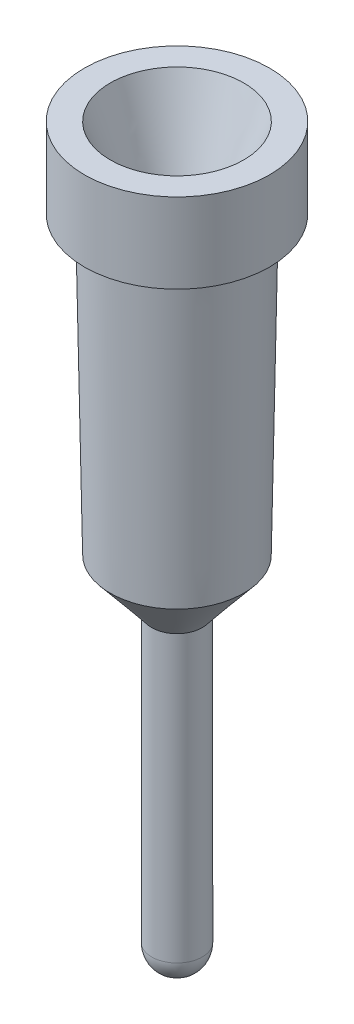
ISO-10303-21;
HEADER;
FILE_DESCRIPTION(('STEP AP214'),'2;1');
FILE_NAME('part.step','',(''),(''),'','','');
FILE_SCHEMA(('AUTOMOTIVE_DESIGN { 1 0 10303 214 1 1 1 1 }'));
ENDSEC;
DATA;
#1=APPLICATION_CONTEXT('core data for automotive mechanical design processes');
#2=APPLICATION_PROTOCOL_DEFINITION('international standard','automotive_design',2000,#1);
#3=PRODUCT_CONTEXT('',#1,'mechanical');
#4=PRODUCT('Part','Part','',(#3));
#5=PRODUCT_RELATED_PRODUCT_CATEGORY('part','',(#4));
#6=PRODUCT_DEFINITION_FORMATION('','',#4);
#7=PRODUCT_DEFINITION_CONTEXT('part definition',#1,'design');
#8=PRODUCT_DEFINITION('design','',#6,#7);
#9=PRODUCT_DEFINITION_SHAPE('','',#8);
#10=(LENGTH_UNIT() NAMED_UNIT(*) SI_UNIT(.MILLI.,.METRE.));
#11=(NAMED_UNIT(*) PLANE_ANGLE_UNIT() SI_UNIT($,.RADIAN.));
#12=(NAMED_UNIT(*) SI_UNIT($,.STERADIAN.) SOLID_ANGLE_UNIT());
#13=UNCERTAINTY_MEASURE_WITH_UNIT(LENGTH_MEASURE(1.E-05),#10,'distance_accuracy_value','');
#14=(GEOMETRIC_REPRESENTATION_CONTEXT(3) GLOBAL_UNCERTAINTY_ASSIGNED_CONTEXT((#13)) GLOBAL_UNIT_ASSIGNED_CONTEXT((#10,
#11,#12)) REPRESENTATION_CONTEXT('',''));
#15=CARTESIAN_POINT('',(0.,0.,0.));
#16=DIRECTION('',(0.,0.,1.));
#17=DIRECTION('',(1.,0.,0.));
#18=AXIS2_PLACEMENT_3D('',#15,#16,#17);
#19=CARTESIAN_POINT('',(0.,0.01,0.));
#20=DIRECTION('',(0.,-1.,0.));
#21=DIRECTION('',(0.,0.,-1.));
#22=AXIS2_PLACEMENT_3D('',#19,#20,#21);
#23=CYLINDRICAL_SURFACE('',#22,0.915);
#24=CARTESIAN_POINT('',(0.,0.01,0.));
#25=DIRECTION('',(0.,1.,0.));
#26=DIRECTION('',(0.,0.,1.));
#27=AXIS2_PLACEMENT_3D('',#24,#25,#26);
#28=CIRCLE('',#27,0.915);
#29=CARTESIAN_POINT('',(0.,0.01,-0.915));
#30=VERTEX_POINT('',#29);
#31=EDGE_CURVE('E48',#30,#30,#28,.T.);
#32=CARTESIAN_POINT('',(0.,-0.78,0.));
#33=DIRECTION('',(0.,1.,0.));
#34=DIRECTION('',(0.,0.,1.));
#35=AXIS2_PLACEMENT_3D('',#32,#33,#34);
#36=CIRCLE('',#35,0.915);
#37=CARTESIAN_POINT('',(0.,-0.78,-0.915));
#38=VERTEX_POINT('',#37);
#39=EDGE_CURVE('E52',#38,#38,#36,.T.);
#40=CARTESIAN_POINT('',(0.,0.01,-0.915));
#41=CARTESIAN_POINT('',(0.,0.00177083333333333,-0.915));
#42=CARTESIAN_POINT('',(0.,-0.00645833333333334,-0.915));
#43=CARTESIAN_POINT('',(0.,-0.0229166666666667,-0.915));
#44=CARTESIAN_POINT('',(0.,-0.0311458333333333,-0.915));
#45=CARTESIAN_POINT('',(0.,-0.0476041666666667,-0.915));
#46=CARTESIAN_POINT('',(0.,-0.0558333333333333,-0.915));
#47=CARTESIAN_POINT('',(0.,-0.0722916666666667,-0.915));
#48=CARTESIAN_POINT('',(0.,-0.0805208333333333,-0.915));
#49=CARTESIAN_POINT('',(0.,-0.0969791666666667,-0.915));
#50=CARTESIAN_POINT('',(0.,-0.105208333333333,-0.915));
#51=CARTESIAN_POINT('',(0.,-0.121666666666667,-0.915));
#52=CARTESIAN_POINT('',(0.,-0.129895833333333,-0.915));
#53=CARTESIAN_POINT('',(0.,-0.146354166666667,-0.915));
#54=CARTESIAN_POINT('',(0.,-0.154583333333333,-0.915));
#55=CARTESIAN_POINT('',(0.,-0.171041666666667,-0.915));
#56=CARTESIAN_POINT('',(0.,-0.179270833333333,-0.915));
#57=CARTESIAN_POINT('',(0.,-0.195729166666667,-0.915));
#58=CARTESIAN_POINT('',(0.,-0.203958333333333,-0.915));
#59=CARTESIAN_POINT('',(0.,-0.220416666666667,-0.915));
#60=CARTESIAN_POINT('',(0.,-0.228645833333333,-0.915));
#61=CARTESIAN_POINT('',(0.,-0.245104166666667,-0.915));
#62=CARTESIAN_POINT('',(0.,-0.253333333333333,-0.915));
#63=CARTESIAN_POINT('',(0.,-0.269791666666667,-0.915));
#64=CARTESIAN_POINT('',(0.,-0.278020833333333,-0.915));
#65=CARTESIAN_POINT('',(0.,-0.294479166666667,-0.915));
#66=CARTESIAN_POINT('',(0.,-0.302708333333333,-0.915));
#67=CARTESIAN_POINT('',(0.,-0.319166666666667,-0.915));
#68=CARTESIAN_POINT('',(0.,-0.327395833333333,-0.915));
#69=CARTESIAN_POINT('',(0.,-0.343854166666667,-0.915));
#70=CARTESIAN_POINT('',(0.,-0.352083333333333,-0.915));
#71=CARTESIAN_POINT('',(0.,-0.368541666666667,-0.915));
#72=CARTESIAN_POINT('',(0.,-0.376770833333333,-0.915));
#73=CARTESIAN_POINT('',(0.,-0.393229166666667,-0.915));
#74=CARTESIAN_POINT('',(0.,-0.401458333333333,-0.915));
#75=CARTESIAN_POINT('',(0.,-0.417916666666667,-0.915));
#76=CARTESIAN_POINT('',(0.,-0.426145833333333,-0.915));
#77=CARTESIAN_POINT('',(0.,-0.442604166666667,-0.915));
#78=CARTESIAN_POINT('',(0.,-0.450833333333333,-0.915));
#79=CARTESIAN_POINT('',(0.,-0.467291666666667,-0.915));
#80=CARTESIAN_POINT('',(0.,-0.475520833333333,-0.915));
#81=CARTESIAN_POINT('',(0.,-0.491979166666667,-0.915));
#82=CARTESIAN_POINT('',(0.,-0.500208333333333,-0.915));
#83=CARTESIAN_POINT('',(0.,-0.516666666666667,-0.915));
#84=CARTESIAN_POINT('',(0.,-0.524895833333333,-0.915));
#85=CARTESIAN_POINT('',(0.,-0.541354166666667,-0.915));
#86=CARTESIAN_POINT('',(0.,-0.549583333333333,-0.915));
#87=CARTESIAN_POINT('',(0.,-0.566041666666667,-0.915));
#88=CARTESIAN_POINT('',(0.,-0.574270833333333,-0.915));
#89=CARTESIAN_POINT('',(0.,-0.590729166666667,-0.915));
#90=CARTESIAN_POINT('',(0.,-0.598958333333333,-0.915));
#91=CARTESIAN_POINT('',(0.,-0.615416666666667,-0.915));
#92=CARTESIAN_POINT('',(0.,-0.623645833333333,-0.915));
#93=CARTESIAN_POINT('',(0.,-0.640104166666667,-0.915));
#94=CARTESIAN_POINT('',(0.,-0.648333333333333,-0.915));
#95=CARTESIAN_POINT('',(0.,-0.664791666666667,-0.915));
#96=CARTESIAN_POINT('',(0.,-0.673020833333333,-0.915));
#97=CARTESIAN_POINT('',(0.,-0.689479166666667,-0.915));
#98=CARTESIAN_POINT('',(0.,-0.697708333333333,-0.915));
#99=CARTESIAN_POINT('',(0.,-0.714166666666667,-0.915));
#100=CARTESIAN_POINT('',(0.,-0.722395833333333,-0.915));
#101=CARTESIAN_POINT('',(0.,-0.738854166666667,-0.915));
#102=CARTESIAN_POINT('',(0.,-0.747083333333333,-0.915));
#103=CARTESIAN_POINT('',(0.,-0.763541666666667,-0.915));
#104=CARTESIAN_POINT('',(0.,-0.771770833333333,-0.915));
#105=CARTESIAN_POINT('',(0.,-0.78,-0.915));
#106=B_SPLINE_CURVE_WITH_KNOTS('',3,(#40,#41,#42,#43,#44,#45,#46,#47,#48,#49,#50,#51,#52,#53,
#54,#55,#56,#57,#58,#59,#60,#61,#62,#63,#64,#65,#66,#67,#68,#69,#70,#71,#72,#73,#74,#75,#76,#77,
#78,#79,#80,#81,#82,#83,#84,#85,#86,#87,#88,#89,#90,#91,#92,#93,#94,#95,#96,#97,#98,#99,#100,
#101,#102,#103,#104,#105),.UNSPECIFIED.,.F.,.F.,(4,2,2,2,2,2,2,2,2,2,2,2,2,2,2,2,2,2,2,2,2,2,2,
2,2,2,2,2,2,2,2,2,4),(0.,0.0246875,0.049375,0.0740625,0.09875,0.1234375,0.148125,0.1728125,
0.1975,0.2221875,0.246875,0.2715625,0.29625,0.3209375,0.345625,0.3703125,0.395,0.4196875,
0.444375,0.4690625,0.49375,0.5184375,0.543125,0.5678125,0.5925,0.6171875,0.641875,0.6665625,
0.69125,0.7159375,0.740625,0.7653125,0.79),.UNSPECIFIED.);
#107=EDGE_CURVE('BSEAM41',#30,#38,#106,.T.);
#108=ORIENTED_EDGE('',*,*,#31,.F.);
#109=ORIENTED_EDGE('',*,*,#39,.T.);
#110=ORIENTED_EDGE('',*,*,#107,.T.);
#111=ORIENTED_EDGE('',*,*,#107,.F.);
#112=EDGE_LOOP('',(#108,#110,#109,#111));
#113=FACE_BOUND('',#112,.T.);
#114=ADVANCED_FACE('F41',(#113),#23,.T.);
#115=CARTESIAN_POINT('',(0.,0.01,0.));
#116=DIRECTION('',(0.,1.,0.));
#117=DIRECTION('',(0.,0.,1.));
#118=AXIS2_PLACEMENT_3D('',#115,#116,#117);
#119=PLANE('',#118);
#120=CARTESIAN_POINT('',(0.,0.01,0.));
#121=DIRECTION('',(0.,1.,0.));
#122=DIRECTION('',(0.,0.,1.));
#123=AXIS2_PLACEMENT_3D('',#120,#121,#122);
#124=CIRCLE('',#123,0.66);
#125=CARTESIAN_POINT('',(-0.190099229769747,0.01,-0.632030286332031));
#126=VERTEX_POINT('',#125);
#127=EDGE_CURVE('E116',#126,#126,#124,.T.);
#128=ORIENTED_EDGE('',*,*,#127,.F.);
#129=EDGE_LOOP('',(#128));
#130=FACE_BOUND('',#129,.T.);
#131=ORIENTED_EDGE('',*,*,#31,.T.);
#132=EDGE_LOOP('',(#131));
#133=FACE_BOUND('',#132,.T.);
#134=ADVANCED_FACE('F183',(#130,#133),#119,.T.);
#135=CARTESIAN_POINT('',(0.,-0.78,0.));
#136=DIRECTION('',(0.,1.,0.));
#137=DIRECTION('',(0.,0.,1.));
#138=AXIS2_PLACEMENT_3D('',#135,#136,#137);
#139=PLANE('',#138);
#140=CARTESIAN_POINT('',(0.,-0.78,0.));
#141=DIRECTION('',(0.,-1.,0.));
#142=DIRECTION('',(0.,0.,-1.));
#143=AXIS2_PLACEMENT_3D('',#140,#141,#142);
#144=CIRCLE('',#143,0.71);
#145=CARTESIAN_POINT('',(0.,-0.78,-0.71));
#146=VERTEX_POINT('',#145);
#147=EDGE_CURVE('E112',#146,#146,#144,.T.);
#148=ORIENTED_EDGE('',*,*,#147,.F.);
#149=EDGE_LOOP('',(#148));
#150=FACE_BOUND('',#149,.T.);
#151=ORIENTED_EDGE('',*,*,#39,.F.);
#152=EDGE_LOOP('',(#151));
#153=FACE_BOUND('',#152,.T.);
#154=ADVANCED_FACE('F188',(#150,#153),#139,.F.);
#155=CARTESIAN_POINT('',(0.,-3.7,0.));
#156=DIRECTION('',(0.,1.,0.));
#157=DIRECTION('',(0.,0.,1.));
#158=AXIS2_PLACEMENT_3D('',#155,#156,#157);
#159=CONICAL_SURFACE('',#158,0.66,0.0171216144097644);
#160=CARTESIAN_POINT('',(0.,-3.7,0.));
#161=DIRECTION('',(0.,-1.,0.));
#162=DIRECTION('',(0.,0.,-1.));
#163=AXIS2_PLACEMENT_3D('',#160,#161,#162);
#164=CIRCLE('',#163,0.66);
#165=CARTESIAN_POINT('',(0.622818826922703,-3.7,-0.21839576193376));
#166=VERTEX_POINT('',#165);
#167=EDGE_CURVE('E57',#166,#166,#164,.T.);
#168=ORIENTED_EDGE('',*,*,#167,.F.);
#169=EDGE_LOOP('',(#168));
#170=FACE_BOUND('',#169,.T.);
#171=ORIENTED_EDGE('',*,*,#147,.T.);
#172=EDGE_LOOP('',(#171));
#173=FACE_BOUND('',#172,.T.);
#174=ADVANCED_FACE('F91',(#170,#173),#159,.T.);
#175=CARTESIAN_POINT('',(0.209810113163095,-4.2,-0.135940120694698));
#176=CARTESIAN_POINT('',(0.622818826922703,-3.7,-0.21839576193376));
#177=CARTESIAN_POINT('',(-0.0620701282263007,-4.2,-0.555560347020889));
#178=CARTESIAN_POINT('',(0.186027303055183,-3.7,-1.46403341577917));
#179=CARTESIAN_POINT('',(-0.481690354552492,-4.2,-0.283680105631493));
#180=CARTESIAN_POINT('',(-1.05961035079022,-3.7,-1.02724189191165));
#181=CARTESIAN_POINT('',(-0.209810113163095,-4.2,0.135940120694698));
#182=CARTESIAN_POINT('',(-0.622818826922703,-3.7,0.21839576193376));
#183=CARTESIAN_POINT('',(0.0620701282263007,-4.2,0.555560347020889));
#184=CARTESIAN_POINT('',(-0.186027303055183,-3.7,1.46403341577917));
#185=CARTESIAN_POINT('',(0.481690354552492,-4.2,0.283680105631493));
#186=CARTESIAN_POINT('',(1.05961035079022,-3.7,1.02724189191165));
#187=CARTESIAN_POINT('',(0.209810113163095,-4.2,-0.135940120694698));
#188=CARTESIAN_POINT('',(0.622818826922703,-3.7,-0.21839576193376));
#189=(BOUNDED_SURFACE() B_SPLINE_SURFACE(3,1,((#175,#176),(#177,#178),(#179,#180),(#181,#182),
(#183,#184),(#185,#186),(#187,#188)),.UNSPECIFIED.,.T.,.F.,.F.) B_SPLINE_SURFACE_WITH_KNOTS((4,
3,4),(2,2),(0.,0.5,1.),(0.,1.),
.UNSPECIFIED.) GEOMETRIC_REPRESENTATION_ITEM() RATIONAL_B_SPLINE_SURFACE(((1.,1.),
(0.333333333333333,0.333333333333333),(0.333333333333333,0.333333333333333),(1.,1.),
(0.333333333333333,0.333333333333333),(0.333333333333333,0.333333333333333),(1.,1.))) REPRESENTATION_ITEM('') SURFACE());
#190=CARTESIAN_POINT('',(0.,-4.2,0.));
#191=DIRECTION('',(0.,-1.,0.));
#192=DIRECTION('',(0.,0.,-1.));
#193=AXIS2_PLACEMENT_3D('',#190,#191,#192);
#194=CIRCLE('',#193,0.25);
#195=CARTESIAN_POINT('',(0.209810113163095,-4.2,-0.135940120694698));
#196=VERTEX_POINT('',#195);
#197=EDGE_CURVE('E65',#196,#196,#194,.T.);
#198=CARTESIAN_POINT('',(0.209810113163095,-4.2,-0.135940120694698));
#199=CARTESIAN_POINT('',(0.214112287264758,-4.19479166666667,-0.136799033624272));
#200=CARTESIAN_POINT('',(0.218414461366421,-4.18958333333333,-0.137657946553845));
#201=CARTESIAN_POINT('',(0.227018809569746,-4.17916666666667,-0.139375772412992));
#202=CARTESIAN_POINT('',(0.231320983671408,-4.17395833333333,-0.140234685342566));
#203=CARTESIAN_POINT('',(0.239925331874734,-4.16354166666667,-0.141952511201713));
#204=CARTESIAN_POINT('',(0.244227505976396,-4.15833333333333,-0.142811424131287));
#205=CARTESIAN_POINT('',(0.252831854179721,-4.14791666666667,-0.144529249990434));
#206=CARTESIAN_POINT('',(0.257134028281384,-4.14270833333333,-0.145388162920007));
#207=CARTESIAN_POINT('',(0.265738376484709,-4.13229166666667,-0.147105988779154));
#208=CARTESIAN_POINT('',(0.270040550586372,-4.12708333333333,-0.147964901708728));
#209=CARTESIAN_POINT('',(0.278644898789697,-4.11666666666667,-0.149682727567875));
#210=CARTESIAN_POINT('',(0.282947072891359,-4.11145833333333,-0.150541640497449));
#211=CARTESIAN_POINT('',(0.291551421094685,-4.10104166666667,-0.152259466356596));
#212=CARTESIAN_POINT('',(0.295853595196347,-4.09583333333333,-0.153118379286169));
#213=CARTESIAN_POINT('',(0.304457943399672,-4.08541666666667,-0.154836205145316));
#214=CARTESIAN_POINT('',(0.308760117501335,-4.08020833333333,-0.15569511807489));
#215=CARTESIAN_POINT('',(0.31736446570466,-4.06979166666667,-0.157412943934037));
#216=CARTESIAN_POINT('',(0.321666639806323,-4.06458333333333,-0.158271856863611));
#217=CARTESIAN_POINT('',(0.330270988009648,-4.05416666666667,-0.159989682722758));
#218=CARTESIAN_POINT('',(0.33457316211131,-4.04895833333333,-0.160848595652331));
#219=CARTESIAN_POINT('',(0.343177510314636,-4.03854166666667,-0.162566421511478));
#220=CARTESIAN_POINT('',(0.347479684416298,-4.03333333333333,-0.163425334441052));
#221=CARTESIAN_POINT('',(0.356084032619623,-4.02291666666667,-0.165143160300199));
#222=CARTESIAN_POINT('',(0.360386206721286,-4.01770833333333,-0.166002073229773));
#223=CARTESIAN_POINT('',(0.368990554924611,-4.00729166666667,-0.16771989908892));
#224=CARTESIAN_POINT('',(0.373292729026273,-4.00208333333333,-0.168578812018493));
#225=CARTESIAN_POINT('',(0.381897077229599,-3.99166666666667,-0.170296637877641));
#226=CARTESIAN_POINT('',(0.386199251331262,-3.98645833333333,-0.171155550807214));
#227=CARTESIAN_POINT('',(0.394803599534587,-3.97604166666667,-0.172873376666361));
#228=CARTESIAN_POINT('',(0.399105773636249,-3.97083333333333,-0.173732289595935));
#229=CARTESIAN_POINT('',(0.407710121839574,-3.96041666666667,-0.175450115455082));
#230=CARTESIAN_POINT('',(0.412012295941237,-3.95520833333333,-0.176309028384655));
#231=CARTESIAN_POINT('',(0.420616644144562,-3.94479166666667,-0.178026854243803));
#232=CARTESIAN_POINT('',(0.424918818246225,-3.93958333333333,-0.178885767173376));
#233=CARTESIAN_POINT('',(0.43352316644955,-3.92916666666667,-0.180603593032523));
#234=CARTESIAN_POINT('',(0.437825340551212,-3.92395833333333,-0.181462505962097));
#235=CARTESIAN_POINT('',(0.446429688754537,-3.91354166666667,-0.183180331821244));
#236=CARTESIAN_POINT('',(0.4507318628562,-3.90833333333333,-0.184039244750818));
#237=CARTESIAN_POINT('',(0.459336211059525,-3.89791666666667,-0.185757070609965));
#238=CARTESIAN_POINT('',(0.463638385161188,-3.89270833333333,-0.186615983539538));
#239=CARTESIAN_POINT('',(0.472242733364513,-3.88229166666667,-0.188333809398685));
#240=CARTESIAN_POINT('',(0.476544907466176,-3.87708333333333,-0.189192722328259));
#241=CARTESIAN_POINT('',(0.485149255669501,-3.86666666666667,-0.190910548187406));
#242=CARTESIAN_POINT('',(0.489451429771163,-3.86145833333333,-0.19176946111698));
#243=CARTESIAN_POINT('',(0.498055777974489,-3.85104166666667,-0.193487286976127));
#244=CARTESIAN_POINT('',(0.502357952076151,-3.84583333333333,-0.1943461999057));
#245=CARTESIAN_POINT('',(0.510962300279476,-3.83541666666667,-0.196064025764847));
#246=CARTESIAN_POINT('',(0.515264474381139,-3.83020833333333,-0.196922938694421));
#247=CARTESIAN_POINT('',(0.523868822584464,-3.81979166666667,-0.198640764553568));
#248=CARTESIAN_POINT('',(0.528170996686127,-3.81458333333333,-0.199499677483142));
#249=CARTESIAN_POINT('',(0.536775344889452,-3.80416666666667,-0.201217503342289));
#250=CARTESIAN_POINT('',(0.541077518991114,-3.79895833333333,-0.202076416271862));
#251=CARTESIAN_POINT('',(0.54968186719444,-3.78854166666667,-0.203794242131009));
#252=CARTESIAN_POINT('',(0.553984041296102,-3.78333333333333,-0.204653155060583));
#253=CARTESIAN_POINT('',(0.562588389499427,-3.77291666666667,-0.20637098091973));
#254=CARTESIAN_POINT('',(0.56689056360109,-3.76770833333333,-0.207229893849304));
#255=CARTESIAN_POINT('',(0.575494911804415,-3.75729166666667,-0.208947719708451));
#256=CARTESIAN_POINT('',(0.579797085906078,-3.75208333333333,-0.209806632638024));
#257=CARTESIAN_POINT('',(0.588401434109403,-3.74166666666667,-0.211524458497171));
#258=CARTESIAN_POINT('',(0.592703608211065,-3.73645833333333,-0.212383371426745));
#259=CARTESIAN_POINT('',(0.60130795641439,-3.72604166666667,-0.214101197285892));
#260=CARTESIAN_POINT('',(0.605610130516053,-3.72083333333333,-0.214960110215466));
#261=CARTESIAN_POINT('',(0.614214478719378,-3.71041666666667,-0.216677936074613));
#262=CARTESIAN_POINT('',(0.618516652821041,-3.70520833333333,-0.217536849004186));
#263=CARTESIAN_POINT('',(0.622818826922703,-3.7,-0.21839576193376));
#264=B_SPLINE_CURVE_WITH_KNOTS('',3,(#198,#199,#200,#201,#202,#203,#204,#205,#206,#207,#208,
#209,#210,#211,#212,#213,#214,#215,#216,#217,#218,#219,#220,#221,#222,#223,#224,#225,#226,#227,
#228,#229,#230,#231,#232,#233,#234,#235,#236,#237,#238,#239,#240,#241,#242,#243,#244,#245,#246,
#247,#248,#249,#250,#251,#252,#253,#254,#255,#256,#257,#258,#259,#260,#261,#262,#263),
.UNSPECIFIED.,.F.,.F.,(4,2,2,2,2,2,2,2,2,2,2,2,2,2,2,2,2,2,2,2,2,2,2,2,2,2,2,2,2,2,2,2,4),(0.,
0.0204293545124276,0.0408587090248551,0.0612880635372827,0.0817174180497103,0.102146772562138,
0.122576127074565,0.143005481586993,0.16343483609942,0.183864190611848,0.204293545124276,
0.224722899636703,0.245152254149131,0.265581608661558,0.286010963173985,0.306440317686413,
0.326869672198841,0.347299026711268,0.367728381223696,0.388157735736123,0.408587090248551,
0.429016444760979,0.449445799273406,0.469875153785834,0.490304508298262,0.510733862810689,
0.531163217323116,0.551592571835544,0.572021926347972,0.592451280860399,0.612880635372827,
0.633309989885254,0.653739344397682),.UNSPECIFIED.);
#265=EDGE_CURVE('BSEAM80',#196,#166,#264,.T.);
#266=ORIENTED_EDGE('',*,*,#197,.F.);
#267=ORIENTED_EDGE('',*,*,#167,.T.);
#268=ORIENTED_EDGE('',*,*,#265,.T.);
#269=ORIENTED_EDGE('',*,*,#265,.F.);
#270=EDGE_LOOP('',(#266,#268,#267,#269));
#271=FACE_BOUND('',#270,.T.);
#272=ADVANCED_FACE('F80',(#271),#189,.T.);
#273=CARTESIAN_POINT('',(0.,-7.27,0.));
#274=DIRECTION('',(0.,1.,0.));
#275=DIRECTION('',(0.,0.,1.));
#276=AXIS2_PLACEMENT_3D('',#273,#274,#275);
#277=CYLINDRICAL_SURFACE('',#276,0.25);
#278=CARTESIAN_POINT('',(0.,-7.02,0.));
#279=DIRECTION('',(0.,1.,0.));
#280=DIRECTION('',(0.,0.,1.));
#281=AXIS2_PLACEMENT_3D('',#278,#279,#280);
#282=CIRCLE('',#281,0.25);
#283=CARTESIAN_POINT('',(0.,-7.02,0.25));
#284=VERTEX_POINT('',#283);
#285=EDGE_CURVE('E11',#284,#284,#282,.T.);
#286=ORIENTED_EDGE('',*,*,#285,.T.);
#287=EDGE_LOOP('',(#286));
#288=FACE_BOUND('',#287,.T.);
#289=ORIENTED_EDGE('',*,*,#197,.T.);
#290=EDGE_LOOP('',(#289));
#291=FACE_BOUND('',#290,.T.);
#292=ADVANCED_FACE('F70',(#288,#291),#277,.T.);
#293=CARTESIAN_POINT('',(0.,-7.02,0.));
#294=DIRECTION('',(0.,0.,1.));
#295=DIRECTION('',(1.,0.,0.));
#296=AXIS2_PLACEMENT_3D('',#293,#294,#295);
#297=SPHERICAL_SURFACE('',#296,0.25);
#298=CARTESIAN_POINT('',(0.,-7.02,0.));
#299=DIRECTION('',(0.,1.,0.));
#300=DIRECTION('',(0.,0.,1.));
#301=AXIS2_PLACEMENT_3D('',#298,#299,#300);
#302=SPHERICAL_SURFACE('',#301,0.25);
#303=ORIENTED_EDGE('',*,*,#285,.F.);
#304=EDGE_LOOP('',(#303));
#305=FACE_BOUND('',#304,.T.);
#306=ADVANCED_FACE('F43',(#305),#302,.T.);
#307=CARTESIAN_POINT('',(-0.190099229769747,0.01,-0.632030286332031));
#308=CARTESIAN_POINT('',(-0.0429027436629655,-0.78,-0.372537722366729));
#309=CARTESIAN_POINT('',(1.07396134289431,0.01,-1.01222874587153));
#310=CARTESIAN_POINT('',(0.702172701070493,-0.78,-0.45834320969266));
#311=CARTESIAN_POINT('',(1.45415980243381,0.01,0.251831826792536));
#312=CARTESIAN_POINT('',(0.787978188396423,-0.78,0.286732235040799));
#313=CARTESIAN_POINT('',(0.190099229769747,0.01,0.632030286332031));
#314=CARTESIAN_POINT('',(0.0429027436629651,-0.78,0.372537722366729));
#315=CARTESIAN_POINT('',(-1.07396134289431,0.01,1.01222874587153));
#316=CARTESIAN_POINT('',(-0.702172701070492,-0.78,0.458343209692659));
#317=CARTESIAN_POINT('',(-1.45415980243381,0.01,-0.251831826792537));
#318=CARTESIAN_POINT('',(-0.787978188396423,-0.78,-0.286732235040799));
#319=CARTESIAN_POINT('',(-0.190099229769747,0.01,-0.632030286332031));
#320=CARTESIAN_POINT('',(-0.0429027436629655,-0.78,-0.372537722366729));
#321=(BOUNDED_SURFACE() B_SPLINE_SURFACE(3,1,((#307,#308),(#309,#310),(#311,#312),(#313,#314),
(#315,#316),(#317,#318),(#319,#320)),.UNSPECIFIED.,.T.,.F.,.F.) B_SPLINE_SURFACE_WITH_KNOTS((4,
3,4),(2,2),(0.,0.5,1.),(0.,1.),
.UNSPECIFIED.) GEOMETRIC_REPRESENTATION_ITEM() RATIONAL_B_SPLINE_SURFACE(((1.,1.),
(0.333333333333333,0.333333333333333),(0.333333333333333,0.333333333333333),(1.,1.),
(0.333333333333333,0.333333333333333),(0.333333333333333,0.333333333333333),(1.,1.))) REPRESENTATION_ITEM('') SURFACE());
#322=CARTESIAN_POINT('',(0.,-0.78,0.));
#323=DIRECTION('',(0.,-1.,0.));
#324=DIRECTION('',(0.,0.,-1.));
#325=AXIS2_PLACEMENT_3D('',#322,#323,#324);
#326=CIRCLE('',#325,0.375);
#327=CARTESIAN_POINT('',(-0.0429027436629655,-0.78,-0.372537722366729));
#328=VERTEX_POINT('',#327);
#329=EDGE_CURVE('E118',#328,#328,#326,.T.);
#330=CARTESIAN_POINT('',(-0.190099229769747,0.01,-0.632030286332031));
#331=CARTESIAN_POINT('',(-0.188565933039468,0.00177083333333331,-0.629327238790726));
#332=CARTESIAN_POINT('',(-0.187032636309189,-0.00645833333333335,-0.62662419124942));
#333=CARTESIAN_POINT('',(-0.183966042848631,-0.0229166666666667,-0.62121809616681));
#334=CARTESIAN_POINT('',(-0.182432746118352,-0.0311458333333333,-0.618515048625505));
#335=CARTESIAN_POINT('',(-0.179366152657794,-0.0476041666666667,-0.613108953542894));
#336=CARTESIAN_POINT('',(-0.177832855927515,-0.0558333333333333,-0.610405906001589));
#337=CARTESIAN_POINT('',(-0.174766262466958,-0.0722916666666667,-0.604999810918979));
#338=CARTESIAN_POINT('',(-0.173232965736679,-0.0805208333333333,-0.602296763377673));
#339=CARTESIAN_POINT('',(-0.170166372276121,-0.0969791666666667,-0.596890668295063));
#340=CARTESIAN_POINT('',(-0.168633075545842,-0.105208333333333,-0.594187620753758));
#341=CARTESIAN_POINT('',(-0.165566482085284,-0.121666666666667,-0.588781525671147));
#342=CARTESIAN_POINT('',(-0.164033185355005,-0.129895833333333,-0.586078478129842));
#343=CARTESIAN_POINT('',(-0.160966591894447,-0.146354166666667,-0.580672383047231));
#344=CARTESIAN_POINT('',(-0.159433295164168,-0.154583333333333,-0.577969335505926));
#345=CARTESIAN_POINT('',(-0.15636670170361,-0.171041666666667,-0.572563240423316));
#346=CARTESIAN_POINT('',(-0.154833404973331,-0.179270833333333,-0.569860192882011));
#347=CARTESIAN_POINT('',(-0.151766811512773,-0.195729166666667,-0.5644540977994));
#348=CARTESIAN_POINT('',(-0.150233514782494,-0.203958333333333,-0.561751050258095));
#349=CARTESIAN_POINT('',(-0.147166921321936,-0.220416666666667,-0.556344955175484));
#350=CARTESIAN_POINT('',(-0.145633624591657,-0.228645833333333,-0.553641907634179));
#351=CARTESIAN_POINT('',(-0.142567031131099,-0.245104166666667,-0.548235812551569));
#352=CARTESIAN_POINT('',(-0.14103373440082,-0.253333333333333,-0.545532765010263));
#353=CARTESIAN_POINT('',(-0.137967140940262,-0.269791666666667,-0.540126669927653));
#354=CARTESIAN_POINT('',(-0.136433844209983,-0.278020833333333,-0.537423622386348));
#355=CARTESIAN_POINT('',(-0.133367250749425,-0.294479166666667,-0.532017527303737));
#356=CARTESIAN_POINT('',(-0.131833954019146,-0.302708333333333,-0.529314479762432));
#357=CARTESIAN_POINT('',(-0.128767360558588,-0.319166666666667,-0.523908384679822));
#358=CARTESIAN_POINT('',(-0.127234063828309,-0.327395833333333,-0.521205337138516));
#359=CARTESIAN_POINT('',(-0.124167470367751,-0.343854166666667,-0.515799242055906));
#360=CARTESIAN_POINT('',(-0.122634173637472,-0.352083333333333,-0.513096194514601));
#361=CARTESIAN_POINT('',(-0.119567580176914,-0.368541666666667,-0.50769009943199));
#362=CARTESIAN_POINT('',(-0.118034283446635,-0.376770833333333,-0.504987051890685));
#363=CARTESIAN_POINT('',(-0.114967689986077,-0.393229166666667,-0.499580956808075));
#364=CARTESIAN_POINT('',(-0.113434393255798,-0.401458333333333,-0.496877909266769));
#365=CARTESIAN_POINT('',(-0.11036779979524,-0.417916666666667,-0.491471814184159));
#366=CARTESIAN_POINT('',(-0.108834503064961,-0.426145833333333,-0.488768766642854));
#367=CARTESIAN_POINT('',(-0.105767909604404,-0.442604166666667,-0.483362671560243));
#368=CARTESIAN_POINT('',(-0.104234612874125,-0.450833333333333,-0.480659624018938));
#369=CARTESIAN_POINT('',(-0.101168019413567,-0.467291666666667,-0.475253528936328));
#370=CARTESIAN_POINT('',(-0.0996347226832876,-0.475520833333333,-0.472550481395022));
#371=CARTESIAN_POINT('',(-0.0965681292227297,-0.491979166666667,-0.467144386312412));
#372=CARTESIAN_POINT('',(-0.0950348324924507,-0.500208333333333,-0.464441338771107));
#373=CARTESIAN_POINT('',(-0.0919682390318927,-0.516666666666667,-0.459035243688496));
#374=CARTESIAN_POINT('',(-0.0904349423016138,-0.524895833333333,-0.456332196147191));
#375=CARTESIAN_POINT('',(-0.0873683488410558,-0.541354166666667,-0.45092610106458));
#376=CARTESIAN_POINT('',(-0.0858350521107768,-0.549583333333333,-0.448223053523275));
#377=CARTESIAN_POINT('',(-0.0827684586502189,-0.566041666666667,-0.442816958440665));
#378=CARTESIAN_POINT('',(-0.0812351619199399,-0.574270833333333,-0.44011391089936));
#379=CARTESIAN_POINT('',(-0.0781685684593819,-0.590729166666667,-0.434707815816749));
#380=CARTESIAN_POINT('',(-0.076635271729103,-0.598958333333333,-0.432004768275444));
#381=CARTESIAN_POINT('',(-0.073568678268545,-0.615416666666667,-0.426598673192833));
#382=CARTESIAN_POINT('',(-0.072035381538266,-0.623645833333333,-0.423895625651528));
#383=CARTESIAN_POINT('',(-0.0689687880777081,-0.640104166666667,-0.418489530568918));
#384=CARTESIAN_POINT('',(-0.0674354913474291,-0.648333333333333,-0.415786483027613));
#385=CARTESIAN_POINT('',(-0.0643688978868711,-0.664791666666667,-0.410380387945002));
#386=CARTESIAN_POINT('',(-0.0628356011565922,-0.673020833333333,-0.407677340403697));
#387=CARTESIAN_POINT('',(-0.0597690076960342,-0.689479166666667,-0.402271245321086));
#388=CARTESIAN_POINT('',(-0.0582357109657552,-0.697708333333333,-0.399568197779781));
#389=CARTESIAN_POINT('',(-0.0551691175051973,-0.714166666666667,-0.394162102697171));
#390=CARTESIAN_POINT('',(-0.0536358207749183,-0.722395833333333,-0.391459055155865));
#391=CARTESIAN_POINT('',(-0.0505692273143603,-0.738854166666667,-0.386052960073255));
#392=CARTESIAN_POINT('',(-0.0490359305840814,-0.747083333333333,-0.38334991253195));
#393=CARTESIAN_POINT('',(-0.0459693371235234,-0.763541666666667,-0.377943817449339));
#394=CARTESIAN_POINT('',(-0.0444360403932444,-0.771770833333333,-0.375240769908034));
#395=CARTESIAN_POINT('',(-0.0429027436629655,-0.78,-0.372537722366729));
#396=B_SPLINE_CURVE_WITH_KNOTS('',3,(#330,#331,#332,#333,#334,#335,#336,#337,#338,#339,#340,
#341,#342,#343,#344,#345,#346,#347,#348,#349,#350,#351,#352,#353,#354,#355,#356,#357,#358,#359,
#360,#361,#362,#363,#364,#365,#366,#367,#368,#369,#370,#371,#372,#373,#374,#375,#376,#377,#378,
#379,#380,#381,#382,#383,#384,#385,#386,#387,#388,#389,#390,#391,#392,#393,#394,#395),
.UNSPECIFIED.,.F.,.F.,(4,2,2,2,2,2,2,2,2,2,2,2,2,2,2,2,2,2,2,2,2,2,2,2,2,2,2,2,2,2,2,2,4),(0.,
0.0263891993079132,0.0527783986158263,0.0791675979237395,0.105556797231653,0.131945996539566,
0.158335195847479,0.184724395155392,0.211113594463305,0.237502793771218,0.263891993079132,
0.290281192387045,0.316670391694958,0.343059591002871,0.369448790310784,0.395837989618697,
0.42222718892661,0.448616388234524,0.475005587542437,0.50139478685035,0.527783986158263,
0.554173185466176,0.580562384774089,0.606951584082002,0.633340783389916,0.659729982697829,
0.686119182005742,0.712508381313655,0.738897580621568,0.765286779929481,0.791675979237394,
0.818065178545307,0.844454377853221),.UNSPECIFIED.);
#397=EDGE_CURVE('BSEAM81',#126,#328,#396,.T.);
#398=ORIENTED_EDGE('',*,*,#127,.T.);
#399=ORIENTED_EDGE('',*,*,#329,.T.);
#400=ORIENTED_EDGE('',*,*,#397,.T.);
#401=ORIENTED_EDGE('',*,*,#397,.F.);
#402=EDGE_LOOP('',(#398,#400,#399,#401));
#403=FACE_BOUND('',#402,.T.);
#404=ADVANCED_FACE('F81',(#403),#321,.F.);
#405=CARTESIAN_POINT('',(0.,-2.49,0.));
#406=DIRECTION('',(0.,1.,0.));
#407=DIRECTION('',(0.,0.,1.));
#408=AXIS2_PLACEMENT_3D('',#405,#406,#407);
#409=PLANE('',#408);
#410=CARTESIAN_POINT('',(0.,-2.49,0.));
#411=DIRECTION('',(0.,1.,0.));
#412=DIRECTION('',(0.,0.,1.));
#413=AXIS2_PLACEMENT_3D('',#410,#411,#412);
#414=CIRCLE('',#413,0.125);
#415=CARTESIAN_POINT('',(0.,-2.49,0.125));
#416=VERTEX_POINT('',#415);
#417=EDGE_CURVE('E122',#416,#416,#414,.T.);
#418=ORIENTED_EDGE('',*,*,#417,.T.);
#419=EDGE_LOOP('',(#418));
#420=FACE_BOUND('',#419,.T.);
#421=ADVANCED_FACE('F144',(#420),#409,.T.);
#422=CARTESIAN_POINT('',(0.,-2.49,0.));
#423=DIRECTION('',(0.,1.,0.));
#424=DIRECTION('',(0.,0.,1.));
#425=AXIS2_PLACEMENT_3D('',#422,#423,#424);
#426=CONICAL_SURFACE('',#425,0.125,0.145170365335674);
#427=ORIENTED_EDGE('',*,*,#329,.F.);
#428=EDGE_LOOP('',(#427));
#429=FACE_BOUND('',#428,.T.);
#430=ORIENTED_EDGE('',*,*,#417,.F.);
#431=EDGE_LOOP('',(#430));
#432=FACE_BOUND('',#431,.T.);
#433=ADVANCED_FACE('F153',(#429,#432),#426,.F.);
#434=CLOSED_SHELL('',(#114,#134,#154,#174,#272,#292,#306,#404,#421,#433));
#435=MANIFOLD_SOLID_BREP('B2',#434);
#436=ADVANCED_BREP_SHAPE_REPRESENTATION('',(#18,#435),#14);
#437=SHAPE_DEFINITION_REPRESENTATION(#9,#436);
ENDSEC;
END-ISO-10303-21;
